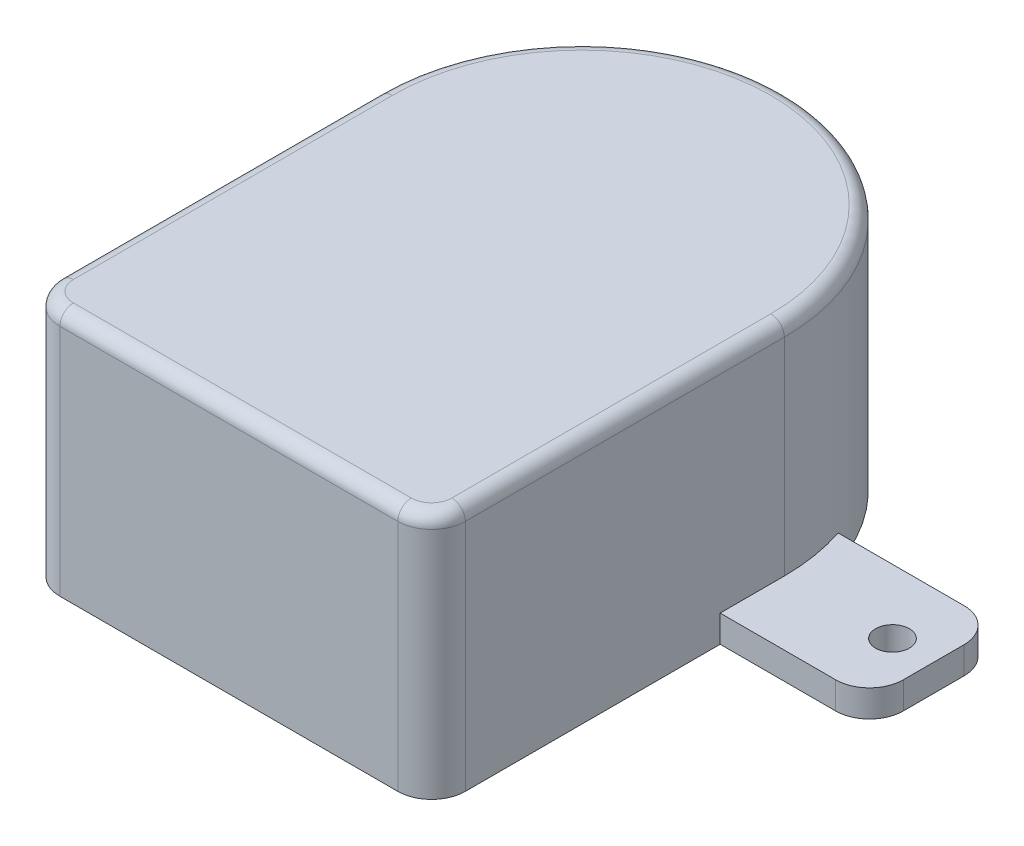
ISO-10303-21;
HEADER;
FILE_DESCRIPTION(('STEP AP214'),'2;1');
FILE_NAME('part.step','',(''),(''),'','','');
FILE_SCHEMA(('AUTOMOTIVE_DESIGN { 1 0 10303 214 1 1 1 1 }'));
ENDSEC;
DATA;
#1=APPLICATION_CONTEXT('core data for automotive mechanical design processes');
#2=APPLICATION_PROTOCOL_DEFINITION('international standard','automotive_design',2000,#1);
#3=PRODUCT_CONTEXT('',#1,'mechanical');
#4=PRODUCT('Part','Part','',(#3));
#5=PRODUCT_RELATED_PRODUCT_CATEGORY('part','',(#4));
#6=PRODUCT_DEFINITION_FORMATION('','',#4);
#7=PRODUCT_DEFINITION_CONTEXT('part definition',#1,'design');
#8=PRODUCT_DEFINITION('design','',#6,#7);
#9=PRODUCT_DEFINITION_SHAPE('','',#8);
#10=(LENGTH_UNIT() NAMED_UNIT(*) SI_UNIT(.MILLI.,.METRE.));
#11=(NAMED_UNIT(*) PLANE_ANGLE_UNIT() SI_UNIT($,.RADIAN.));
#12=(NAMED_UNIT(*) SI_UNIT($,.STERADIAN.) SOLID_ANGLE_UNIT());
#13=UNCERTAINTY_MEASURE_WITH_UNIT(LENGTH_MEASURE(1.E-05),#10,'distance_accuracy_value','');
#14=(GEOMETRIC_REPRESENTATION_CONTEXT(3) GLOBAL_UNCERTAINTY_ASSIGNED_CONTEXT((#13)) GLOBAL_UNIT_ASSIGNED_CONTEXT((#10,
#11,#12)) REPRESENTATION_CONTEXT('',''));
#15=CARTESIAN_POINT('',(0.,0.,0.));
#16=DIRECTION('',(0.,0.,1.));
#17=DIRECTION('',(1.,0.,0.));
#18=AXIS2_PLACEMENT_3D('',#15,#16,#17);
#19=CARTESIAN_POINT('',(0.,18.3,0.));
#20=DIRECTION('',(0.,-1.,0.));
#21=DIRECTION('',(0.,0.,-1.));
#22=AXIS2_PLACEMENT_3D('',#19,#20,#21);
#23=CYLINDRICAL_SURFACE('',#22,15.);
#24=DIRECTION('',(0.,-1.,0.));
#25=VECTOR('',#24,1.);
#26=CARTESIAN_POINT('',(-15.,18.3,0.));
#27=LINE('',#26,#25);
#28=CARTESIAN_POINT('',(-15.,17.3,0.));
#29=VERTEX_POINT('',#28);
#30=CARTESIAN_POINT('',(-15.,2.,0.));
#31=VERTEX_POINT('',#30);
#32=EDGE_CURVE('E239',#29,#31,#27,.T.);
#33=ORIENTED_EDGE('',*,*,#32,.F.);
#34=CARTESIAN_POINT('',(0.,17.3,0.));
#35=DIRECTION('',(0.,1.,0.));
#36=DIRECTION('',(0.,0.,1.));
#37=AXIS2_PLACEMENT_3D('',#34,#35,#36);
#38=CIRCLE('',#37,15.);
#39=CARTESIAN_POINT('',(15.,17.3,0.));
#40=VERTEX_POINT('',#39);
#41=EDGE_CURVE('E43',#29,#40,#38,.F.);
#42=ORIENTED_EDGE('',*,*,#41,.T.);
#43=DIRECTION('',(0.,-1.,0.));
#44=VECTOR('',#43,1.);
#45=CARTESIAN_POINT('',(15.,18.3,0.));
#46=LINE('',#45,#44);
#47=CARTESIAN_POINT('',(15.,2.,0.));
#48=VERTEX_POINT('',#47);
#49=EDGE_CURVE('E237',#40,#48,#46,.T.);
#50=ORIENTED_EDGE('',*,*,#49,.T.);
#51=CARTESIAN_POINT('',(0.,2.,0.));
#52=DIRECTION('',(0.,1.,0.));
#53=DIRECTION('',(0.,0.,1.));
#54=AXIS2_PLACEMENT_3D('',#51,#52,#53);
#55=CIRCLE('',#54,15.);
#56=CARTESIAN_POINT('',(14.2280532751322,2.,-4.75));
#57=VERTEX_POINT('',#56);
#58=EDGE_CURVE('E222',#48,#57,#55,.T.);
#59=ORIENTED_EDGE('',*,*,#58,.T.);
#60=DIRECTION('',(0.,-1.,0.));
#61=VECTOR('',#60,1.);
#62=CARTESIAN_POINT('',(14.2280532751322,18.3,-4.75));
#63=LINE('',#62,#61);
#64=CARTESIAN_POINT('',(14.2280532751322,0.,-4.75));
#65=VERTEX_POINT('',#64);
#66=EDGE_CURVE('E186',#65,#57,#63,.F.);
#67=ORIENTED_EDGE('',*,*,#66,.F.);
#68=CARTESIAN_POINT('',(0.,0.,0.));
#69=DIRECTION('',(0.,1.,0.));
#70=DIRECTION('',(0.,0.,1.));
#71=AXIS2_PLACEMENT_3D('',#68,#69,#70);
#72=CIRCLE('',#71,15.);
#73=CARTESIAN_POINT('',(-14.2280532751322,0.,-4.75));
#74=VERTEX_POINT('',#73);
#75=EDGE_CURVE('E227',#65,#74,#72,.T.);
#76=ORIENTED_EDGE('',*,*,#75,.T.);
#77=DIRECTION('',(0.,-1.,0.));
#78=VECTOR('',#77,1.);
#79=CARTESIAN_POINT('',(-14.2280532751322,18.3,-4.75));
#80=LINE('',#79,#78);
#81=CARTESIAN_POINT('',(-14.2280532751322,2.,-4.75));
#82=VERTEX_POINT('',#81);
#83=EDGE_CURVE('E219',#82,#74,#80,.T.);
#84=ORIENTED_EDGE('',*,*,#83,.F.);
#85=EDGE_CURVE('E225',#82,#31,#55,.T.);
#86=ORIENTED_EDGE('',*,*,#85,.T.);
#87=EDGE_LOOP('',(#33,#42,#50,#59,#67,#76,#84,#86));
#88=FACE_BOUND('',#87,.T.);
#89=ADVANCED_FACE('F34',(#88),#23,.T.);
#90=CARTESIAN_POINT('',(-15.,18.3,0.));
#91=DIRECTION('',(1.,0.,0.));
#92=DIRECTION('',(0.,0.,-1.));
#93=AXIS2_PLACEMENT_3D('',#90,#91,#92);
#94=PLANE('',#93);
#95=DIRECTION('',(0.,-1.,0.));
#96=VECTOR('',#95,1.);
#97=CARTESIAN_POINT('',(-15.,18.3,23.6));
#98=LINE('',#97,#96);
#99=CARTESIAN_POINT('',(-15.,0.,23.6));
#100=VERTEX_POINT('',#99);
#101=CARTESIAN_POINT('',(-15.,17.3,23.6));
#102=VERTEX_POINT('',#101);
#103=EDGE_CURVE('E253',#100,#102,#98,.F.);
#104=ORIENTED_EDGE('',*,*,#103,.T.);
#105=DIRECTION('',(0.,0.,1.));
#106=VECTOR('',#105,1.);
#107=CARTESIAN_POINT('',(-15.,17.3,0.));
#108=LINE('',#107,#106);
#109=EDGE_CURVE('E58',#102,#29,#108,.F.);
#110=ORIENTED_EDGE('',*,*,#109,.T.);
#111=ORIENTED_EDGE('',*,*,#32,.T.);
#112=DIRECTION('',(0.,0.,1.));
#113=VECTOR('',#112,1.);
#114=CARTESIAN_POINT('',(-15.,2.,0.));
#115=LINE('',#114,#113);
#116=CARTESIAN_POINT('',(-15.,2.,4.75));
#117=VERTEX_POINT('',#116);
#118=EDGE_CURVE('E224',#31,#117,#115,.T.);
#119=ORIENTED_EDGE('',*,*,#118,.T.);
#120=DIRECTION('',(0.,1.,0.));
#121=VECTOR('',#120,1.);
#122=CARTESIAN_POINT('',(-15.,18.3,4.75));
#123=LINE('',#122,#121);
#124=CARTESIAN_POINT('',(-15.,0.,4.75));
#125=VERTEX_POINT('',#124);
#126=EDGE_CURVE('E209',#125,#117,#123,.T.);
#127=ORIENTED_EDGE('',*,*,#126,.F.);
#128=DIRECTION('',(0.,0.,1.));
#129=VECTOR('',#128,1.);
#130=CARTESIAN_POINT('',(-15.,0.,0.));
#131=LINE('',#130,#129);
#132=EDGE_CURVE('E229',#125,#100,#131,.T.);
#133=ORIENTED_EDGE('',*,*,#132,.T.);
#134=EDGE_LOOP('',(#104,#110,#111,#119,#127,#133));
#135=FACE_BOUND('',#134,.T.);
#136=ADVANCED_FACE('F434',(#135),#94,.F.);
#137=CARTESIAN_POINT('',(-15.,18.3,26.1));
#138=DIRECTION('',(0.,0.,-1.));
#139=DIRECTION('',(-1.,0.,0.));
#140=AXIS2_PLACEMENT_3D('',#137,#138,#139);
#141=PLANE('',#140);
#142=DIRECTION('',(0.,-1.,0.));
#143=VECTOR('',#142,1.);
#144=CARTESIAN_POINT('',(12.5,18.3,26.1));
#145=LINE('',#144,#143);
#146=CARTESIAN_POINT('',(12.5,0.,26.1));
#147=VERTEX_POINT('',#146);
#148=CARTESIAN_POINT('',(12.5,17.3,26.1));
#149=VERTEX_POINT('',#148);
#150=EDGE_CURVE('E244',#147,#149,#145,.F.);
#151=ORIENTED_EDGE('',*,*,#150,.T.);
#152=DIRECTION('',(1.,0.,0.));
#153=VECTOR('',#152,1.);
#154=CARTESIAN_POINT('',(-12.5,17.3,26.1));
#155=LINE('',#154,#153);
#156=CARTESIAN_POINT('',(-12.5,17.3,26.1));
#157=VERTEX_POINT('',#156);
#158=EDGE_CURVE('E278',#149,#157,#155,.F.);
#159=ORIENTED_EDGE('',*,*,#158,.T.);
#160=DIRECTION('',(0.,-1.,0.));
#161=VECTOR('',#160,1.);
#162=CARTESIAN_POINT('',(-12.5,18.3,26.1));
#163=LINE('',#162,#161);
#164=CARTESIAN_POINT('',(-12.5,0.,26.1));
#165=VERTEX_POINT('',#164);
#166=EDGE_CURVE('E247',#157,#165,#163,.T.);
#167=ORIENTED_EDGE('',*,*,#166,.T.);
#168=DIRECTION('',(1.,0.,0.));
#169=VECTOR('',#168,1.);
#170=CARTESIAN_POINT('',(-15.,0.,26.1));
#171=LINE('',#170,#169);
#172=EDGE_CURVE('E232',#165,#147,#171,.T.);
#173=ORIENTED_EDGE('',*,*,#172,.T.);
#174=EDGE_LOOP('',(#151,#159,#167,#173));
#175=FACE_BOUND('',#174,.T.);
#176=ADVANCED_FACE('F428',(#175),#141,.F.);
#177=CARTESIAN_POINT('',(15.,18.3,26.1));
#178=DIRECTION('',(-1.,0.,0.));
#179=DIRECTION('',(0.,0.,1.));
#180=AXIS2_PLACEMENT_3D('',#177,#178,#179);
#181=PLANE('',#180);
#182=ORIENTED_EDGE('',*,*,#49,.F.);
#183=DIRECTION('',(0.,0.,-1.));
#184=VECTOR('',#183,1.);
#185=CARTESIAN_POINT('',(15.,17.3,23.6));
#186=LINE('',#185,#184);
#187=CARTESIAN_POINT('',(15.,17.3,23.6));
#188=VERTEX_POINT('',#187);
#189=EDGE_CURVE('E11',#40,#188,#186,.F.);
#190=ORIENTED_EDGE('',*,*,#189,.T.);
#191=DIRECTION('',(0.,-1.,0.));
#192=VECTOR('',#191,1.);
#193=CARTESIAN_POINT('',(15.,18.3,23.6));
#194=LINE('',#193,#192);
#195=CARTESIAN_POINT('',(15.,0.,23.6));
#196=VERTEX_POINT('',#195);
#197=EDGE_CURVE('E255',#188,#196,#194,.T.);
#198=ORIENTED_EDGE('',*,*,#197,.T.);
#199=DIRECTION('',(0.,0.,-1.));
#200=VECTOR('',#199,1.);
#201=CARTESIAN_POINT('',(15.,0.,26.1));
#202=LINE('',#201,#200);
#203=CARTESIAN_POINT('',(15.,0.,4.75));
#204=VERTEX_POINT('',#203);
#205=EDGE_CURVE('E235',#196,#204,#202,.T.);
#206=ORIENTED_EDGE('',*,*,#205,.T.);
#207=DIRECTION('',(0.,-1.,0.));
#208=VECTOR('',#207,1.);
#209=CARTESIAN_POINT('',(15.,18.3,4.75));
#210=LINE('',#209,#208);
#211=CARTESIAN_POINT('',(15.,2.,4.75));
#212=VERTEX_POINT('',#211);
#213=EDGE_CURVE('E205',#212,#204,#210,.T.);
#214=ORIENTED_EDGE('',*,*,#213,.F.);
#215=DIRECTION('',(0.,0.,-1.));
#216=VECTOR('',#215,1.);
#217=CARTESIAN_POINT('',(15.,2.,26.1));
#218=LINE('',#217,#216);
#219=EDGE_CURVE('E241',#212,#48,#218,.T.);
#220=ORIENTED_EDGE('',*,*,#219,.T.);
#221=EDGE_LOOP('',(#182,#190,#198,#206,#214,#220));
#222=FACE_BOUND('',#221,.T.);
#223=ADVANCED_FACE('F420',(#222),#181,.F.);
#224=CARTESIAN_POINT('',(0.,18.3,0.));
#225=DIRECTION('',(0.,1.,0.));
#226=DIRECTION('',(0.,0.,1.));
#227=AXIS2_PLACEMENT_3D('',#224,#225,#226);
#228=PLANE('',#227);
#229=DIRECTION('',(1.,0.,0.));
#230=VECTOR('',#229,1.);
#231=CARTESIAN_POINT('',(12.5,18.3,25.1));
#232=LINE('',#231,#230);
#233=CARTESIAN_POINT('',(-12.5,18.3,25.1));
#234=VERTEX_POINT('',#233);
#235=CARTESIAN_POINT('',(12.5,18.3,25.1));
#236=VERTEX_POINT('',#235);
#237=EDGE_CURVE('E270',#234,#236,#232,.T.);
#238=ORIENTED_EDGE('',*,*,#237,.T.);
#239=CARTESIAN_POINT('',(12.5,18.3,23.6));
#240=DIRECTION('',(0.,1.,0.));
#241=DIRECTION('',(0.,0.,1.));
#242=AXIS2_PLACEMENT_3D('',#239,#240,#241);
#243=CIRCLE('',#242,1.5);
#244=CARTESIAN_POINT('',(14.,18.3,23.6));
#245=VERTEX_POINT('',#244);
#246=EDGE_CURVE('E272',#236,#245,#243,.T.);
#247=ORIENTED_EDGE('',*,*,#246,.T.);
#248=DIRECTION('',(0.,0.,-1.));
#249=VECTOR('',#248,1.);
#250=CARTESIAN_POINT('',(14.,18.3,0.));
#251=LINE('',#250,#249);
#252=CARTESIAN_POINT('',(14.,18.3,0.));
#253=VERTEX_POINT('',#252);
#254=EDGE_CURVE('E257',#245,#253,#251,.T.);
#255=ORIENTED_EDGE('',*,*,#254,.T.);
#256=CARTESIAN_POINT('',(0.,18.3,0.));
#257=DIRECTION('',(0.,1.,0.));
#258=DIRECTION('',(0.,0.,1.));
#259=AXIS2_PLACEMENT_3D('',#256,#257,#258);
#260=CIRCLE('',#259,14.);
#261=CARTESIAN_POINT('',(-14.,18.3,0.));
#262=VERTEX_POINT('',#261);
#263=EDGE_CURVE('E264',#253,#262,#260,.T.);
#264=ORIENTED_EDGE('',*,*,#263,.T.);
#265=DIRECTION('',(0.,0.,1.));
#266=VECTOR('',#265,1.);
#267=CARTESIAN_POINT('',(-14.,18.3,23.6));
#268=LINE('',#267,#266);
#269=CARTESIAN_POINT('',(-14.,18.3,23.6));
#270=VERTEX_POINT('',#269);
#271=EDGE_CURVE('E266',#262,#270,#268,.T.);
#272=ORIENTED_EDGE('',*,*,#271,.T.);
#273=CARTESIAN_POINT('',(-12.5,18.3,23.6));
#274=DIRECTION('',(0.,1.,0.));
#275=DIRECTION('',(0.,0.,1.));
#276=AXIS2_PLACEMENT_3D('',#273,#274,#275);
#277=CIRCLE('',#276,1.5);
#278=EDGE_CURVE('E268',#270,#234,#277,.T.);
#279=ORIENTED_EDGE('',*,*,#278,.T.);
#280=EDGE_LOOP('',(#238,#247,#255,#264,#272,#279));
#281=FACE_BOUND('',#280,.T.);
#282=ADVANCED_FACE('F444',(#281),#228,.T.);
#283=CARTESIAN_POINT('',(0.,0.,0.));
#284=DIRECTION('',(0.,1.,0.));
#285=DIRECTION('',(0.,0.,1.));
#286=AXIS2_PLACEMENT_3D('',#283,#284,#285);
#287=PLANE('',#286);
#288=CARTESIAN_POINT('',(0.,0.,-0.0999999999999925));
#289=DIRECTION('',(0.,-1.,0.));
#290=DIRECTION('',(0.,0.,-1.));
#291=AXIS2_PLACEMENT_3D('',#288,#289,#290);
#292=CIRCLE('',#291,5.5);
#293=CARTESIAN_POINT('',(0.,0.,-5.59999999999999));
#294=VERTEX_POINT('',#293);
#295=EDGE_CURVE('E261',#294,#294,#292,.T.);
#296=ORIENTED_EDGE('',*,*,#295,.F.);
#297=EDGE_LOOP('',(#296));
#298=FACE_BOUND('',#297,.T.);
#299=ORIENTED_EDGE('',*,*,#172,.F.);
#300=CARTESIAN_POINT('',(-12.5,0.,23.6));
#301=DIRECTION('',(0.,1.,0.));
#302=DIRECTION('',(0.,0.,1.));
#303=AXIS2_PLACEMENT_3D('',#300,#301,#302);
#304=CIRCLE('',#303,2.5);
#305=EDGE_CURVE('E251',#165,#100,#304,.F.);
#306=ORIENTED_EDGE('',*,*,#305,.T.);
#307=ORIENTED_EDGE('',*,*,#132,.F.);
#308=DIRECTION('',(1.,0.,0.));
#309=VECTOR('',#308,1.);
#310=CARTESIAN_POINT('',(23.55,0.,4.75));
#311=LINE('',#310,#309);
#312=CARTESIAN_POINT('',(-23.55,0.,4.75));
#313=VERTEX_POINT('',#312);
#314=EDGE_CURVE('E349',#313,#125,#311,.T.);
#315=ORIENTED_EDGE('',*,*,#314,.F.);
#316=CARTESIAN_POINT('',(-23.55,0.,2.25));
#317=DIRECTION('',(0.,1.,0.));
#318=DIRECTION('',(0.,0.,-1.));
#319=AXIS2_PLACEMENT_3D('',#316,#317,#318);
#320=CIRCLE('',#319,2.5);
#321=CARTESIAN_POINT('',(-26.05,0.,2.24999999999999));
#322=VERTEX_POINT('',#321);
#323=EDGE_CURVE('E346',#322,#313,#320,.T.);
#324=ORIENTED_EDGE('',*,*,#323,.F.);
#325=DIRECTION('',(0.,0.,1.));
#326=VECTOR('',#325,1.);
#327=CARTESIAN_POINT('',(-26.05,0.,2.24999999999999));
#328=LINE('',#327,#326);
#329=CARTESIAN_POINT('',(-26.05,0.,-2.24999999999998));
#330=VERTEX_POINT('',#329);
#331=EDGE_CURVE('E344',#330,#322,#328,.T.);
#332=ORIENTED_EDGE('',*,*,#331,.F.);
#333=CARTESIAN_POINT('',(-23.55,0.,-2.25));
#334=DIRECTION('',(0.,1.,0.));
#335=DIRECTION('',(0.,0.,1.));
#336=AXIS2_PLACEMENT_3D('',#333,#334,#335);
#337=CIRCLE('',#336,2.5);
#338=CARTESIAN_POINT('',(-23.55,0.,-4.75));
#339=VERTEX_POINT('',#338);
#340=EDGE_CURVE('E342',#339,#330,#337,.T.);
#341=ORIENTED_EDGE('',*,*,#340,.F.);
#342=DIRECTION('',(-1.,0.,0.));
#343=VECTOR('',#342,1.);
#344=CARTESIAN_POINT('',(23.55,0.,-4.75));
#345=LINE('',#344,#343);
#346=EDGE_CURVE('E339',#74,#339,#345,.T.);
#347=ORIENTED_EDGE('',*,*,#346,.F.);
#348=ORIENTED_EDGE('',*,*,#75,.F.);
#349=CARTESIAN_POINT('',(23.55,0.,-4.75));
#350=VERTEX_POINT('',#349);
#351=EDGE_CURVE('E340',#350,#65,#345,.T.);
#352=ORIENTED_EDGE('',*,*,#351,.F.);
#353=CARTESIAN_POINT('',(23.55,0.,-2.25));
#354=DIRECTION('',(0.,1.,0.));
#355=DIRECTION('',(0.,0.,1.));
#356=AXIS2_PLACEMENT_3D('',#353,#354,#355);
#357=CIRCLE('',#356,2.5);
#358=CARTESIAN_POINT('',(26.05,0.,-2.24999999999998));
#359=VERTEX_POINT('',#358);
#360=EDGE_CURVE('E204',#359,#350,#357,.T.);
#361=ORIENTED_EDGE('',*,*,#360,.F.);
#362=DIRECTION('',(0.,0.,-1.));
#363=VECTOR('',#362,1.);
#364=CARTESIAN_POINT('',(26.05,0.,2.24999999999998));
#365=LINE('',#364,#363);
#366=CARTESIAN_POINT('',(26.05,0.,2.24999999999998));
#367=VERTEX_POINT('',#366);
#368=EDGE_CURVE('E200',#367,#359,#365,.T.);
#369=ORIENTED_EDGE('',*,*,#368,.F.);
#370=CARTESIAN_POINT('',(23.55,0.,2.25));
#371=DIRECTION('',(0.,1.,0.));
#372=DIRECTION('',(0.,0.,1.));
#373=AXIS2_PLACEMENT_3D('',#370,#371,#372);
#374=CIRCLE('',#373,2.5);
#375=CARTESIAN_POINT('',(23.55,0.,4.75));
#376=VERTEX_POINT('',#375);
#377=EDGE_CURVE('E352',#376,#367,#374,.T.);
#378=ORIENTED_EDGE('',*,*,#377,.F.);
#379=EDGE_CURVE('E348',#204,#376,#311,.T.);
#380=ORIENTED_EDGE('',*,*,#379,.F.);
#381=ORIENTED_EDGE('',*,*,#205,.F.);
#382=CARTESIAN_POINT('',(12.5,0.,23.6));
#383=DIRECTION('',(0.,1.,0.));
#384=DIRECTION('',(0.,0.,1.));
#385=AXIS2_PLACEMENT_3D('',#382,#383,#384);
#386=CIRCLE('',#385,2.5);
#387=EDGE_CURVE('E249',#196,#147,#386,.F.);
#388=ORIENTED_EDGE('',*,*,#387,.T.);
#389=EDGE_LOOP('',(#299,#306,#307,#315,#324,#332,#341,#347,#348,#352,#361,#369,#378,#380,#381,#388));
#390=FACE_BOUND('',#389,.T.);
#391=CARTESIAN_POINT('',(23.,0.,0.));
#392=DIRECTION('',(0.,1.,0.));
#393=DIRECTION('',(0.,0.,1.));
#394=AXIS2_PLACEMENT_3D('',#391,#392,#393);
#395=CIRCLE('',#394,1.25);
#396=CARTESIAN_POINT('',(23.,0.,1.24999999999999));
#397=VERTEX_POINT('',#396);
#398=EDGE_CURVE('E317',#397,#397,#395,.T.);
#399=ORIENTED_EDGE('',*,*,#398,.T.);
#400=EDGE_LOOP('',(#399));
#401=FACE_BOUND('',#400,.T.);
#402=CARTESIAN_POINT('',(-23.,0.,0.));
#403=DIRECTION('',(0.,1.,0.));
#404=DIRECTION('',(0.,0.,1.));
#405=AXIS2_PLACEMENT_3D('',#402,#403,#404);
#406=CIRCLE('',#405,1.25);
#407=CARTESIAN_POINT('',(-23.,0.,1.25));
#408=VERTEX_POINT('',#407);
#409=EDGE_CURVE('E311',#408,#408,#406,.T.);
#410=ORIENTED_EDGE('',*,*,#409,.T.);
#411=EDGE_LOOP('',(#410));
#412=FACE_BOUND('',#411,.T.);
#413=ADVANCED_FACE('F380',(#298,#390,#401,#412),#287,.F.);
#414=CARTESIAN_POINT('',(26.05,2.,2.24999999999998));
#415=DIRECTION('',(-1.,0.,0.));
#416=DIRECTION('',(0.,0.,1.));
#417=AXIS2_PLACEMENT_3D('',#414,#415,#416);
#418=PLANE('',#417);
#419=ORIENTED_EDGE('',*,*,#368,.T.);
#420=DIRECTION('',(0.,-1.,0.));
#421=VECTOR('',#420,1.);
#422=CARTESIAN_POINT('',(26.05,2.,-2.24999999999998));
#423=LINE('',#422,#421);
#424=CARTESIAN_POINT('',(26.05,2.,-2.24999999999998));
#425=VERTEX_POINT('',#424);
#426=EDGE_CURVE('E337',#425,#359,#423,.T.);
#427=ORIENTED_EDGE('',*,*,#426,.F.);
#428=DIRECTION('',(0.,0.,-1.));
#429=VECTOR('',#428,1.);
#430=CARTESIAN_POINT('',(26.05,2.,2.24999999999998));
#431=LINE('',#430,#429);
#432=CARTESIAN_POINT('',(26.05,2.,2.24999999999998));
#433=VERTEX_POINT('',#432);
#434=EDGE_CURVE('E196',#433,#425,#431,.T.);
#435=ORIENTED_EDGE('',*,*,#434,.F.);
#436=DIRECTION('',(0.,-1.,0.));
#437=VECTOR('',#436,1.);
#438=CARTESIAN_POINT('',(26.05,2.,2.24999999999998));
#439=LINE('',#438,#437);
#440=EDGE_CURVE('E356',#433,#367,#439,.T.);
#441=ORIENTED_EDGE('',*,*,#440,.T.);
#442=EDGE_LOOP('',(#419,#427,#435,#441));
#443=FACE_BOUND('',#442,.T.);
#444=ADVANCED_FACE('F417',(#443),#418,.F.);
#445=CARTESIAN_POINT('',(23.55,2.,-2.25));
#446=DIRECTION('',(0.,-1.,0.));
#447=DIRECTION('',(0.,0.,-1.));
#448=AXIS2_PLACEMENT_3D('',#445,#446,#447);
#449=CYLINDRICAL_SURFACE('',#448,2.5);
#450=ORIENTED_EDGE('',*,*,#360,.T.);
#451=DIRECTION('',(0.,-1.,0.));
#452=VECTOR('',#451,1.);
#453=CARTESIAN_POINT('',(23.55,2.,-4.75));
#454=LINE('',#453,#452);
#455=CARTESIAN_POINT('',(23.55,2.,-4.75));
#456=VERTEX_POINT('',#455);
#457=EDGE_CURVE('E184',#456,#350,#454,.T.);
#458=ORIENTED_EDGE('',*,*,#457,.F.);
#459=CARTESIAN_POINT('',(23.55,2.,-2.25));
#460=DIRECTION('',(0.,1.,0.));
#461=DIRECTION('',(0.,0.,1.));
#462=AXIS2_PLACEMENT_3D('',#459,#460,#461);
#463=CIRCLE('',#462,2.5);
#464=EDGE_CURVE('E193',#425,#456,#463,.T.);
#465=ORIENTED_EDGE('',*,*,#464,.F.);
#466=ORIENTED_EDGE('',*,*,#426,.T.);
#467=EDGE_LOOP('',(#450,#458,#465,#466));
#468=FACE_BOUND('',#467,.T.);
#469=ADVANCED_FACE('F202',(#468),#449,.T.);
#470=CARTESIAN_POINT('',(23.,2.,0.));
#471=DIRECTION('',(0.,-1.,0.));
#472=DIRECTION('',(0.,0.,-1.));
#473=AXIS2_PLACEMENT_3D('',#470,#471,#472);
#474=CYLINDRICAL_SURFACE('',#473,1.25);
#475=CARTESIAN_POINT('',(23.,2.,0.));
#476=DIRECTION('',(0.,1.,0.));
#477=DIRECTION('',(0.,0.,1.));
#478=AXIS2_PLACEMENT_3D('',#475,#476,#477);
#479=CIRCLE('',#478,1.25);
#480=CARTESIAN_POINT('',(23.,2.,1.24999999999999));
#481=VERTEX_POINT('',#480);
#482=EDGE_CURVE('E320',#481,#481,#479,.T.);
#483=ORIENTED_EDGE('',*,*,#482,.T.);
#484=EDGE_LOOP('',(#483));
#485=FACE_BOUND('',#484,.T.);
#486=ORIENTED_EDGE('',*,*,#398,.F.);
#487=EDGE_LOOP('',(#486));
#488=FACE_BOUND('',#487,.T.);
#489=ADVANCED_FACE('F493',(#485,#488),#474,.F.);
#490=CARTESIAN_POINT('',(23.55,2.,2.25));
#491=DIRECTION('',(0.,-1.,0.));
#492=DIRECTION('',(0.,0.,-1.));
#493=AXIS2_PLACEMENT_3D('',#490,#491,#492);
#494=CYLINDRICAL_SURFACE('',#493,2.5);
#495=ORIENTED_EDGE('',*,*,#377,.T.);
#496=ORIENTED_EDGE('',*,*,#440,.F.);
#497=CARTESIAN_POINT('',(23.55,2.,2.25));
#498=DIRECTION('',(0.,1.,0.));
#499=DIRECTION('',(0.,0.,1.));
#500=AXIS2_PLACEMENT_3D('',#497,#498,#499);
#501=CIRCLE('',#500,2.5);
#502=CARTESIAN_POINT('',(23.55,2.,4.75));
#503=VERTEX_POINT('',#502);
#504=EDGE_CURVE('E334',#503,#433,#501,.T.);
#505=ORIENTED_EDGE('',*,*,#504,.F.);
#506=DIRECTION('',(0.,-1.,0.));
#507=VECTOR('',#506,1.);
#508=CARTESIAN_POINT('',(23.55,2.,4.75));
#509=LINE('',#508,#507);
#510=EDGE_CURVE('E359',#503,#376,#509,.T.);
#511=ORIENTED_EDGE('',*,*,#510,.T.);
#512=EDGE_LOOP('',(#495,#496,#505,#511));
#513=FACE_BOUND('',#512,.T.);
#514=ADVANCED_FACE('F414',(#513),#494,.T.);
#515=CARTESIAN_POINT('',(23.55,2.,4.75));
#516=DIRECTION('',(0.,0.,-1.));
#517=DIRECTION('',(-1.,0.,0.));
#518=AXIS2_PLACEMENT_3D('',#515,#516,#517);
#519=PLANE('',#518);
#520=DIRECTION('',(1.,0.,0.));
#521=VECTOR('',#520,1.);
#522=CARTESIAN_POINT('',(23.55,2.,4.75));
#523=LINE('',#522,#521);
#524=EDGE_CURVE('E330',#212,#503,#523,.T.);
#525=ORIENTED_EDGE('',*,*,#524,.F.);
#526=ORIENTED_EDGE('',*,*,#213,.T.);
#527=ORIENTED_EDGE('',*,*,#379,.T.);
#528=ORIENTED_EDGE('',*,*,#510,.F.);
#529=EDGE_LOOP('',(#525,#526,#527,#528));
#530=FACE_BOUND('',#529,.T.);
#531=ADVANCED_FACE('F408',(#530),#519,.F.);
#532=CARTESIAN_POINT('',(23.55,2.,-2.25));
#533=DIRECTION('',(0.,1.,0.));
#534=DIRECTION('',(0.,0.,1.));
#535=AXIS2_PLACEMENT_3D('',#532,#533,#534);
#536=PLANE('',#535);
#537=ORIENTED_EDGE('',*,*,#482,.F.);
#538=EDGE_LOOP('',(#537));
#539=FACE_BOUND('',#538,.T.);
#540=ORIENTED_EDGE('',*,*,#58,.F.);
#541=ORIENTED_EDGE('',*,*,#219,.F.);
#542=ORIENTED_EDGE('',*,*,#524,.T.);
#543=ORIENTED_EDGE('',*,*,#504,.T.);
#544=ORIENTED_EDGE('',*,*,#434,.T.);
#545=ORIENTED_EDGE('',*,*,#464,.T.);
#546=DIRECTION('',(-1.,0.,0.));
#547=VECTOR('',#546,1.);
#548=CARTESIAN_POINT('',(23.55,2.,-4.75));
#549=LINE('',#548,#547);
#550=EDGE_CURVE('E179',#456,#57,#549,.T.);
#551=ORIENTED_EDGE('',*,*,#550,.T.);
#552=EDGE_LOOP('',(#540,#541,#542,#543,#544,#545,#551));
#553=FACE_BOUND('',#552,.T.);
#554=ADVANCED_FACE('F194',(#539,#553),#536,.T.);
#555=CARTESIAN_POINT('',(23.55,2.,-4.75));
#556=DIRECTION('',(0.,0.,1.));
#557=DIRECTION('',(1.,0.,0.));
#558=AXIS2_PLACEMENT_3D('',#555,#556,#557);
#559=PLANE('',#558);
#560=ORIENTED_EDGE('',*,*,#351,.T.);
#561=ORIENTED_EDGE('',*,*,#66,.T.);
#562=ORIENTED_EDGE('',*,*,#550,.F.);
#563=ORIENTED_EDGE('',*,*,#457,.T.);
#564=EDGE_LOOP('',(#560,#561,#562,#563));
#565=FACE_BOUND('',#564,.T.);
#566=ADVANCED_FACE('F182',(#565),#559,.F.);
#567=CARTESIAN_POINT('',(-23.,2.,0.));
#568=DIRECTION('',(0.,1.,0.));
#569=DIRECTION('',(0.,0.,1.));
#570=AXIS2_PLACEMENT_3D('',#567,#568,#569);
#571=CIRCLE('',#570,1.25);
#572=CARTESIAN_POINT('',(-23.,2.,1.25));
#573=VERTEX_POINT('',#572);
#574=EDGE_CURVE('E314',#573,#573,#571,.T.);
#575=ORIENTED_EDGE('',*,*,#574,.F.);
#576=EDGE_LOOP('',(#575));
#577=FACE_BOUND('',#576,.T.);
#578=ORIENTED_EDGE('',*,*,#85,.F.);
#579=CARTESIAN_POINT('',(-23.55,2.,-4.75));
#580=VERTEX_POINT('',#579);
#581=EDGE_CURVE('E190',#82,#580,#549,.T.);
#582=ORIENTED_EDGE('',*,*,#581,.T.);
#583=CARTESIAN_POINT('',(-23.55,2.,-2.25));
#584=DIRECTION('',(0.,1.,0.));
#585=DIRECTION('',(0.,0.,1.));
#586=AXIS2_PLACEMENT_3D('',#583,#584,#585);
#587=CIRCLE('',#586,2.5);
#588=CARTESIAN_POINT('',(-26.05,2.,-2.24999999999998));
#589=VERTEX_POINT('',#588);
#590=EDGE_CURVE('E189',#580,#589,#587,.T.);
#591=ORIENTED_EDGE('',*,*,#590,.T.);
#592=DIRECTION('',(0.,0.,1.));
#593=VECTOR('',#592,1.);
#594=CARTESIAN_POINT('',(-26.05,2.,2.24999999999999));
#595=LINE('',#594,#593);
#596=CARTESIAN_POINT('',(-26.05,2.,2.24999999999999));
#597=VERTEX_POINT('',#596);
#598=EDGE_CURVE('E326',#589,#597,#595,.T.);
#599=ORIENTED_EDGE('',*,*,#598,.T.);
#600=CARTESIAN_POINT('',(-23.55,2.,2.25));
#601=DIRECTION('',(0.,1.,0.));
#602=DIRECTION('',(0.,0.,-1.));
#603=AXIS2_PLACEMENT_3D('',#600,#601,#602);
#604=CIRCLE('',#603,2.5);
#605=CARTESIAN_POINT('',(-23.55,2.,4.75));
#606=VERTEX_POINT('',#605);
#607=EDGE_CURVE('E328',#597,#606,#604,.T.);
#608=ORIENTED_EDGE('',*,*,#607,.T.);
#609=EDGE_CURVE('E331',#606,#117,#523,.T.);
#610=ORIENTED_EDGE('',*,*,#609,.T.);
#611=ORIENTED_EDGE('',*,*,#118,.F.);
#612=EDGE_LOOP('',(#578,#582,#591,#599,#608,#610,#611));
#613=FACE_BOUND('',#612,.T.);
#614=ADVANCED_FACE('F395',(#577,#613),#536,.T.);
#615=ORIENTED_EDGE('',*,*,#581,.F.);
#616=ORIENTED_EDGE('',*,*,#83,.T.);
#617=ORIENTED_EDGE('',*,*,#346,.T.);
#618=DIRECTION('',(0.,-1.,0.));
#619=VECTOR('',#618,1.);
#620=CARTESIAN_POINT('',(-23.55,2.,-4.75));
#621=LINE('',#620,#619);
#622=EDGE_CURVE('E206',#580,#339,#621,.T.);
#623=ORIENTED_EDGE('',*,*,#622,.F.);
#624=EDGE_LOOP('',(#615,#616,#617,#623));
#625=FACE_BOUND('',#624,.T.);
#626=ADVANCED_FACE('F400',(#625),#559,.F.);
#627=ORIENTED_EDGE('',*,*,#314,.T.);
#628=ORIENTED_EDGE('',*,*,#126,.T.);
#629=ORIENTED_EDGE('',*,*,#609,.F.);
#630=DIRECTION('',(0.,-1.,0.));
#631=VECTOR('',#630,1.);
#632=CARTESIAN_POINT('',(-23.55,2.,4.75));
#633=LINE('',#632,#631);
#634=EDGE_CURVE('E362',#606,#313,#633,.T.);
#635=ORIENTED_EDGE('',*,*,#634,.T.);
#636=EDGE_LOOP('',(#627,#628,#629,#635));
#637=FACE_BOUND('',#636,.T.);
#638=ADVANCED_FACE('F391',(#637),#519,.F.);
#639=CARTESIAN_POINT('',(-23.55,2.,-2.25));
#640=DIRECTION('',(0.,-1.,0.));
#641=DIRECTION('',(0.,0.,-1.));
#642=AXIS2_PLACEMENT_3D('',#639,#640,#641);
#643=CYLINDRICAL_SURFACE('',#642,2.5);
#644=ORIENTED_EDGE('',*,*,#340,.T.);
#645=DIRECTION('',(0.,-1.,0.));
#646=VECTOR('',#645,1.);
#647=CARTESIAN_POINT('',(-26.05,2.,-2.24999999999998));
#648=LINE('',#647,#646);
#649=EDGE_CURVE('E212',#589,#330,#648,.T.);
#650=ORIENTED_EDGE('',*,*,#649,.F.);
#651=ORIENTED_EDGE('',*,*,#590,.F.);
#652=ORIENTED_EDGE('',*,*,#622,.T.);
#653=EDGE_LOOP('',(#644,#650,#651,#652));
#654=FACE_BOUND('',#653,.T.);
#655=ADVANCED_FACE('F398',(#654),#643,.T.);
#656=CARTESIAN_POINT('',(-26.05,2.,2.24999999999999));
#657=DIRECTION('',(1.,0.,0.));
#658=DIRECTION('',(0.,0.,-1.));
#659=AXIS2_PLACEMENT_3D('',#656,#657,#658);
#660=PLANE('',#659);
#661=ORIENTED_EDGE('',*,*,#331,.T.);
#662=DIRECTION('',(0.,-1.,0.));
#663=VECTOR('',#662,1.);
#664=CARTESIAN_POINT('',(-26.05,2.,2.24999999999999));
#665=LINE('',#664,#663);
#666=EDGE_CURVE('E365',#597,#322,#665,.T.);
#667=ORIENTED_EDGE('',*,*,#666,.F.);
#668=ORIENTED_EDGE('',*,*,#598,.F.);
#669=ORIENTED_EDGE('',*,*,#649,.T.);
#670=EDGE_LOOP('',(#661,#667,#668,#669));
#671=FACE_BOUND('',#670,.T.);
#672=ADVANCED_FACE('F372',(#671),#660,.F.);
#673=CARTESIAN_POINT('',(-23.55,2.,2.25));
#674=DIRECTION('',(0.,-1.,0.));
#675=DIRECTION('',(0.,0.,-1.));
#676=AXIS2_PLACEMENT_3D('',#673,#674,#675);
#677=CYLINDRICAL_SURFACE('',#676,2.5);
#678=ORIENTED_EDGE('',*,*,#323,.T.);
#679=ORIENTED_EDGE('',*,*,#634,.F.);
#680=ORIENTED_EDGE('',*,*,#607,.F.);
#681=ORIENTED_EDGE('',*,*,#666,.T.);
#682=EDGE_LOOP('',(#678,#679,#680,#681));
#683=FACE_BOUND('',#682,.T.);
#684=ADVANCED_FACE('F387',(#683),#677,.T.);
#685=CARTESIAN_POINT('',(-23.,2.,0.));
#686=DIRECTION('',(0.,-1.,0.));
#687=DIRECTION('',(0.,0.,-1.));
#688=AXIS2_PLACEMENT_3D('',#685,#686,#687);
#689=CYLINDRICAL_SURFACE('',#688,1.25);
#690=ORIENTED_EDGE('',*,*,#574,.T.);
#691=EDGE_LOOP('',(#690));
#692=FACE_BOUND('',#691,.T.);
#693=ORIENTED_EDGE('',*,*,#409,.F.);
#694=EDGE_LOOP('',(#693));
#695=FACE_BOUND('',#694,.T.);
#696=ADVANCED_FACE('F471',(#692,#695),#689,.F.);
#697=CARTESIAN_POINT('',(-12.5,18.3,23.6));
#698=DIRECTION('',(0.,-1.,0.));
#699=DIRECTION('',(0.,0.,-1.));
#700=AXIS2_PLACEMENT_3D('',#697,#698,#699);
#701=CYLINDRICAL_SURFACE('',#700,2.5);
#702=ORIENTED_EDGE('',*,*,#166,.F.);
#703=CARTESIAN_POINT('',(-12.5,17.3,23.6));
#704=DIRECTION('',(0.,1.,0.));
#705=DIRECTION('',(0.,0.,1.));
#706=AXIS2_PLACEMENT_3D('',#703,#704,#705);
#707=CIRCLE('',#706,2.5);
#708=EDGE_CURVE('E280',#157,#102,#707,.F.);
#709=ORIENTED_EDGE('',*,*,#708,.T.);
#710=ORIENTED_EDGE('',*,*,#103,.F.);
#711=ORIENTED_EDGE('',*,*,#305,.F.);
#712=EDGE_LOOP('',(#702,#709,#710,#711));
#713=FACE_BOUND('',#712,.T.);
#714=ADVANCED_FACE('F435',(#713),#701,.T.);
#715=CARTESIAN_POINT('',(12.5,18.3,23.6));
#716=DIRECTION('',(0.,-1.,0.));
#717=DIRECTION('',(0.,0.,-1.));
#718=AXIS2_PLACEMENT_3D('',#715,#716,#717);
#719=CYLINDRICAL_SURFACE('',#718,2.5);
#720=ORIENTED_EDGE('',*,*,#197,.F.);
#721=CARTESIAN_POINT('',(12.5,17.3,23.6));
#722=DIRECTION('',(0.,1.,0.));
#723=DIRECTION('',(0.,0.,1.));
#724=AXIS2_PLACEMENT_3D('',#721,#722,#723);
#725=CIRCLE('',#724,2.5);
#726=EDGE_CURVE('E275',#188,#149,#725,.F.);
#727=ORIENTED_EDGE('',*,*,#726,.T.);
#728=ORIENTED_EDGE('',*,*,#150,.F.);
#729=ORIENTED_EDGE('',*,*,#387,.F.);
#730=EDGE_LOOP('',(#720,#727,#728,#729));
#731=FACE_BOUND('',#730,.T.);
#732=ADVANCED_FACE('F426',(#731),#719,.T.);
#733=CARTESIAN_POINT('',(0.,5.,-0.0999999999999925));
#734=DIRECTION('',(0.,-1.,0.));
#735=DIRECTION('',(0.,0.,-1.));
#736=AXIS2_PLACEMENT_3D('',#733,#734,#735);
#737=CYLINDRICAL_SURFACE('',#736,5.5);
#738=CARTESIAN_POINT('',(0.,5.,-0.0999999999999925));
#739=DIRECTION('',(0.,-1.,0.));
#740=DIRECTION('',(0.,0.,-1.));
#741=AXIS2_PLACEMENT_3D('',#738,#739,#740);
#742=CIRCLE('',#741,5.5);
#743=CARTESIAN_POINT('',(0.,5.,-5.59999999999999));
#744=VERTEX_POINT('',#743);
#745=EDGE_CURVE('E308',#744,#744,#742,.T.);
#746=ORIENTED_EDGE('',*,*,#745,.F.);
#747=EDGE_LOOP('',(#746));
#748=FACE_BOUND('',#747,.T.);
#749=ORIENTED_EDGE('',*,*,#295,.T.);
#750=EDGE_LOOP('',(#749));
#751=FACE_BOUND('',#750,.T.);
#752=ADVANCED_FACE('F473',(#748,#751),#737,.F.);
#753=CARTESIAN_POINT('',(0.,5.,-0.0999999999999925));
#754=DIRECTION('',(0.,-1.,0.));
#755=DIRECTION('',(0.,0.,-1.));
#756=AXIS2_PLACEMENT_3D('',#753,#754,#755);
#757=PLANE('',#756);
#758=CARTESIAN_POINT('',(0.,5.,-0.0999999999999925));
#759=DIRECTION('',(0.,-1.,0.));
#760=DIRECTION('',(0.,0.,-1.));
#761=AXIS2_PLACEMENT_3D('',#758,#759,#760);
#762=CIRCLE('',#761,4.);
#763=CARTESIAN_POINT('',(0.,5.,-4.09999999999999));
#764=VERTEX_POINT('',#763);
#765=EDGE_CURVE('E258',#764,#764,#762,.T.);
#766=ORIENTED_EDGE('',*,*,#765,.F.);
#767=EDGE_LOOP('',(#766));
#768=FACE_BOUND('',#767,.T.);
#769=ORIENTED_EDGE('',*,*,#745,.T.);
#770=EDGE_LOOP('',(#769));
#771=FACE_BOUND('',#770,.T.);
#772=ADVANCED_FACE('F477',(#768,#771),#757,.T.);
#773=CARTESIAN_POINT('',(0.,15.,-0.0999999999999925));
#774=DIRECTION('',(0.,-1.,0.));
#775=DIRECTION('',(0.,0.,-1.));
#776=AXIS2_PLACEMENT_3D('',#773,#774,#775);
#777=CYLINDRICAL_SURFACE('',#776,4.);
#778=ORIENTED_EDGE('',*,*,#765,.T.);
#779=EDGE_LOOP('',(#778));
#780=FACE_BOUND('',#779,.T.);
#781=CARTESIAN_POINT('',(0.,15.,-0.0999999999999925));
#782=DIRECTION('',(0.,-1.,0.));
#783=DIRECTION('',(0.,0.,-1.));
#784=AXIS2_PLACEMENT_3D('',#781,#782,#783);
#785=CIRCLE('',#784,4.);
#786=CARTESIAN_POINT('',(0.,15.,-4.09999999999999));
#787=VERTEX_POINT('',#786);
#788=EDGE_CURVE('E262',#787,#787,#785,.T.);
#789=ORIENTED_EDGE('',*,*,#788,.F.);
#790=EDGE_LOOP('',(#789));
#791=FACE_BOUND('',#790,.T.);
#792=ADVANCED_FACE('F483',(#780,#791),#777,.F.);
#793=CARTESIAN_POINT('',(0.,15.,-0.0999999999999925));
#794=DIRECTION('',(0.,-1.,0.));
#795=DIRECTION('',(0.,0.,-1.));
#796=AXIS2_PLACEMENT_3D('',#793,#794,#795);
#797=PLANE('',#796);
#798=ORIENTED_EDGE('',*,*,#788,.T.);
#799=EDGE_LOOP('',(#798));
#800=FACE_BOUND('',#799,.T.);
#801=ADVANCED_FACE('F617',(#800),#797,.T.);
#802=CARTESIAN_POINT('',(-14.,17.3,0.));
#803=DIRECTION('',(0.,0.,-1.));
#804=DIRECTION('',(-1.,0.,0.));
#805=AXIS2_PLACEMENT_3D('',#802,#803,#804);
#806=CYLINDRICAL_SURFACE('',#805,1.);
#807=CARTESIAN_POINT('',(-14.,17.3,0.));
#808=DIRECTION('',(0.,0.,-1.));
#809=DIRECTION('',(-1.,0.,0.));
#810=AXIS2_PLACEMENT_3D('',#807,#808,#809);
#811=CIRCLE('',#810,1.);
#812=EDGE_CURVE('E293',#29,#262,#811,.T.);
#813=ORIENTED_EDGE('',*,*,#812,.F.);
#814=ORIENTED_EDGE('',*,*,#109,.F.);
#815=CARTESIAN_POINT('',(-14.,17.3,23.6));
#816=DIRECTION('',(0.,0.,1.));
#817=DIRECTION('',(1.,0.,0.));
#818=AXIS2_PLACEMENT_3D('',#815,#816,#817);
#819=CIRCLE('',#818,1.);
#820=EDGE_CURVE('E38',#270,#102,#819,.T.);
#821=ORIENTED_EDGE('',*,*,#820,.F.);
#822=ORIENTED_EDGE('',*,*,#271,.F.);
#823=EDGE_LOOP('',(#813,#814,#821,#822));
#824=FACE_BOUND('',#823,.T.);
#825=ADVANCED_FACE('F36',(#824),#806,.T.);
#826=CARTESIAN_POINT('',(-12.5,17.3,23.6));
#827=DIRECTION('',(0.,1.,0.));
#828=DIRECTION('',(0.,0.,1.));
#829=AXIS2_PLACEMENT_3D('',#826,#827,#828);
#830=TOROIDAL_SURFACE('',#829,1.5,1.);
#831=ORIENTED_EDGE('',*,*,#820,.T.);
#832=ORIENTED_EDGE('',*,*,#708,.F.);
#833=CARTESIAN_POINT('',(-12.5,17.3,25.1));
#834=DIRECTION('',(1.,0.,0.));
#835=DIRECTION('',(0.,0.,-1.));
#836=AXIS2_PLACEMENT_3D('',#833,#834,#835);
#837=CIRCLE('',#836,1.);
#838=EDGE_CURVE('E291',#234,#157,#837,.T.);
#839=ORIENTED_EDGE('',*,*,#838,.F.);
#840=ORIENTED_EDGE('',*,*,#278,.F.);
#841=EDGE_LOOP('',(#831,#832,#839,#840));
#842=FACE_BOUND('',#841,.T.);
#843=ADVANCED_FACE('F437',(#842),#830,.T.);
#844=CARTESIAN_POINT('',(0.,17.3,0.));
#845=DIRECTION('',(0.,1.,0.));
#846=DIRECTION('',(0.,0.,1.));
#847=AXIS2_PLACEMENT_3D('',#844,#845,#846);
#848=TOROIDAL_SURFACE('',#847,14.,1.);
#849=ORIENTED_EDGE('',*,*,#812,.T.);
#850=ORIENTED_EDGE('',*,*,#263,.F.);
#851=CARTESIAN_POINT('',(14.,17.3,0.));
#852=DIRECTION('',(0.,0.,1.));
#853=DIRECTION('',(1.,0.,0.));
#854=AXIS2_PLACEMENT_3D('',#851,#852,#853);
#855=CIRCLE('',#854,1.);
#856=EDGE_CURVE('E288',#40,#253,#855,.T.);
#857=ORIENTED_EDGE('',*,*,#856,.F.);
#858=ORIENTED_EDGE('',*,*,#41,.F.);
#859=EDGE_LOOP('',(#849,#850,#857,#858));
#860=FACE_BOUND('',#859,.T.);
#861=ADVANCED_FACE('F448',(#860),#848,.T.);
#862=CARTESIAN_POINT('',(0.,17.3,25.1));
#863=DIRECTION('',(-1.,0.,0.));
#864=DIRECTION('',(0.,0.,1.));
#865=AXIS2_PLACEMENT_3D('',#862,#863,#864);
#866=CYLINDRICAL_SURFACE('',#865,1.);
#867=ORIENTED_EDGE('',*,*,#838,.T.);
#868=ORIENTED_EDGE('',*,*,#158,.F.);
#869=CARTESIAN_POINT('',(12.5,17.3,25.1));
#870=DIRECTION('',(1.,0.,0.));
#871=DIRECTION('',(0.,0.,-1.));
#872=AXIS2_PLACEMENT_3D('',#869,#870,#871);
#873=CIRCLE('',#872,1.);
#874=EDGE_CURVE('E286',#236,#149,#873,.T.);
#875=ORIENTED_EDGE('',*,*,#874,.F.);
#876=ORIENTED_EDGE('',*,*,#237,.F.);
#877=EDGE_LOOP('',(#867,#868,#875,#876));
#878=FACE_BOUND('',#877,.T.);
#879=ADVANCED_FACE('F440',(#878),#866,.T.);
#880=CARTESIAN_POINT('',(14.,17.3,0.));
#881=DIRECTION('',(0.,0.,1.));
#882=DIRECTION('',(1.,0.,0.));
#883=AXIS2_PLACEMENT_3D('',#880,#881,#882);
#884=CYLINDRICAL_SURFACE('',#883,1.);
#885=ORIENTED_EDGE('',*,*,#856,.T.);
#886=ORIENTED_EDGE('',*,*,#254,.F.);
#887=CARTESIAN_POINT('',(14.,17.3,23.6));
#888=DIRECTION('',(0.,0.,1.));
#889=DIRECTION('',(1.,0.,0.));
#890=AXIS2_PLACEMENT_3D('',#887,#888,#889);
#891=CIRCLE('',#890,1.);
#892=EDGE_CURVE('E284',#188,#245,#891,.T.);
#893=ORIENTED_EDGE('',*,*,#892,.F.);
#894=ORIENTED_EDGE('',*,*,#189,.F.);
#895=EDGE_LOOP('',(#885,#886,#893,#894));
#896=FACE_BOUND('',#895,.T.);
#897=ADVANCED_FACE('F452',(#896),#884,.T.);
#898=CARTESIAN_POINT('',(12.5,17.3,23.6));
#899=DIRECTION('',(0.,1.,0.));
#900=DIRECTION('',(0.,0.,1.));
#901=AXIS2_PLACEMENT_3D('',#898,#899,#900);
#902=TOROIDAL_SURFACE('',#901,1.5,1.);
#903=ORIENTED_EDGE('',*,*,#874,.T.);
#904=ORIENTED_EDGE('',*,*,#726,.F.);
#905=ORIENTED_EDGE('',*,*,#892,.T.);
#906=ORIENTED_EDGE('',*,*,#246,.F.);
#907=EDGE_LOOP('',(#903,#904,#905,#906));
#908=FACE_BOUND('',#907,.T.);
#909=ADVANCED_FACE('F454',(#908),#902,.T.);
#910=CLOSED_SHELL('',(#89,#136,#176,#223,#282,#413,#444,#469,#489,#514,#531,#554,#566,#614,#626,
#638,#655,#672,#684,#696,#714,#732,#752,#772,#792,#801,#825,#843,#861,#879,#897,#909));
#911=MANIFOLD_SOLID_BREP('B2',#910);
#912=ADVANCED_BREP_SHAPE_REPRESENTATION('',(#18,#911),#14);
#913=SHAPE_DEFINITION_REPRESENTATION(#9,#912);
ENDSEC;
END-ISO-10303-21;
